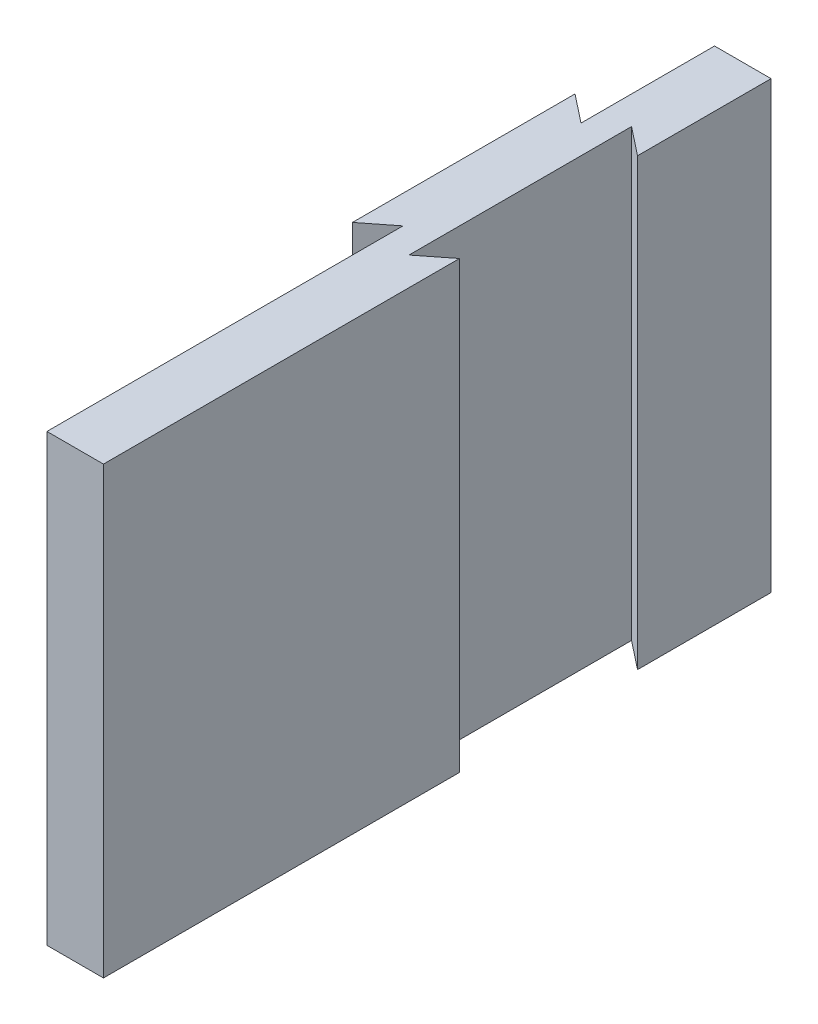
ISO-10303-21;
HEADER;
FILE_DESCRIPTION(('STEP AP214'),'2;1');
FILE_NAME('part.step','',(''),(''),'','','');
FILE_SCHEMA(('AUTOMOTIVE_DESIGN { 1 0 10303 214 1 1 1 1 }'));
ENDSEC;
DATA;
#1=APPLICATION_CONTEXT('core data for automotive mechanical design processes');
#2=APPLICATION_PROTOCOL_DEFINITION('international standard','automotive_design',2000,#1);
#3=PRODUCT_CONTEXT('',#1,'mechanical');
#4=PRODUCT('Part','Part','',(#3));
#5=PRODUCT_RELATED_PRODUCT_CATEGORY('part','',(#4));
#6=PRODUCT_DEFINITION_FORMATION('','',#4);
#7=PRODUCT_DEFINITION_CONTEXT('part definition',#1,'design');
#8=PRODUCT_DEFINITION('design','',#6,#7);
#9=PRODUCT_DEFINITION_SHAPE('','',#8);
#10=(LENGTH_UNIT() NAMED_UNIT(*) SI_UNIT(.MILLI.,.METRE.));
#11=(NAMED_UNIT(*) PLANE_ANGLE_UNIT() SI_UNIT($,.RADIAN.));
#12=(NAMED_UNIT(*) SI_UNIT($,.STERADIAN.) SOLID_ANGLE_UNIT());
#13=UNCERTAINTY_MEASURE_WITH_UNIT(LENGTH_MEASURE(1.E-05),#10,'distance_accuracy_value','');
#14=(GEOMETRIC_REPRESENTATION_CONTEXT(3) GLOBAL_UNCERTAINTY_ASSIGNED_CONTEXT((#13)) GLOBAL_UNIT_ASSIGNED_CONTEXT((#10,
#11,#12)) REPRESENTATION_CONTEXT('',''));
#15=CARTESIAN_POINT('',(0.,0.,0.));
#16=DIRECTION('',(0.,0.,1.));
#17=DIRECTION('',(1.,0.,0.));
#18=AXIS2_PLACEMENT_3D('',#15,#16,#17);
#19=CARTESIAN_POINT('',(1.27,20.,0.));
#20=DIRECTION('',(-1.,0.,0.));
#21=DIRECTION('',(0.,0.,1.));
#22=AXIS2_PLACEMENT_3D('',#19,#20,#21);
#23=PLANE('',#22);
#24=DIRECTION('',(0.,0.,-1.));
#25=VECTOR('',#24,1.);
#26=CARTESIAN_POINT('',(1.27,0.,0.));
#27=LINE('',#26,#25);
#28=CARTESIAN_POINT('',(1.27,0.,-4.));
#29=VERTEX_POINT('',#28);
#30=CARTESIAN_POINT('',(1.27,0.,-9.99999999999999));
#31=VERTEX_POINT('',#30);
#32=EDGE_CURVE('E190',#29,#31,#27,.T.);
#33=ORIENTED_EDGE('',*,*,#32,.T.);
#34=DIRECTION('',(0.,-1.,0.));
#35=VECTOR('',#34,1.);
#36=CARTESIAN_POINT('',(1.27,20.,-9.99999999999999));
#37=LINE('',#36,#35);
#38=CARTESIAN_POINT('',(1.27,20.,-9.99999999999999));
#39=VERTEX_POINT('',#38);
#40=EDGE_CURVE('E208',#39,#31,#37,.T.);
#41=ORIENTED_EDGE('',*,*,#40,.F.);
#42=DIRECTION('',(0.,0.,-1.));
#43=VECTOR('',#42,1.);
#44=CARTESIAN_POINT('',(1.27,20.,0.));
#45=LINE('',#44,#43);
#46=CARTESIAN_POINT('',(1.27,20.,-4.));
#47=VERTEX_POINT('',#46);
#48=EDGE_CURVE('E265',#47,#39,#45,.T.);
#49=ORIENTED_EDGE('',*,*,#48,.F.);
#50=DIRECTION('',(0.,-1.,0.));
#51=VECTOR('',#50,1.);
#52=CARTESIAN_POINT('',(1.27,20.,-4.));
#53=LINE('',#52,#51);
#54=EDGE_CURVE('E212',#47,#29,#53,.T.);
#55=ORIENTED_EDGE('',*,*,#54,.T.);
#56=EDGE_LOOP('',(#33,#41,#49,#55));
#57=FACE_BOUND('',#56,.T.);
#58=ADVANCED_FACE('F77',(#57),#23,.F.);
#59=CARTESIAN_POINT('',(2.43024991388878,20.,-3.08641739063876));
#60=DIRECTION('',(-0.618640866636087,0.,0.785673900627831));
#61=DIRECTION('',(0.785673900627831,0.,0.618640866636087));
#62=AXIS2_PLACEMENT_3D('',#59,#60,#61);
#63=PLANE('',#62);
#64=DIRECTION('',(-0.785673900627831,0.,-0.618640866636087));
#65=VECTOR('',#64,1.);
#66=CARTESIAN_POINT('',(2.43024991388878,0.,-3.08641739063876));
#67=LINE('',#66,#65);
#68=CARTESIAN_POINT('',(0.,0.,-5.));
#69=VERTEX_POINT('',#68);
#70=EDGE_CURVE('E227',#29,#69,#67,.T.);
#71=ORIENTED_EDGE('',*,*,#70,.F.);
#72=ORIENTED_EDGE('',*,*,#54,.F.);
#73=DIRECTION('',(-0.785673900627831,0.,-0.618640866636087));
#74=VECTOR('',#73,1.);
#75=CARTESIAN_POINT('',(2.43024991388878,20.,-3.08641739063876));
#76=LINE('',#75,#74);
#77=CARTESIAN_POINT('',(0.,20.,-5.));
#78=VERTEX_POINT('',#77);
#79=EDGE_CURVE('E230',#47,#78,#76,.T.);
#80=ORIENTED_EDGE('',*,*,#79,.T.);
#81=DIRECTION('',(0.,-1.,0.));
#82=VECTOR('',#81,1.);
#83=CARTESIAN_POINT('',(0.,20.,-5.));
#84=LINE('',#83,#82);
#85=EDGE_CURVE('E166',#78,#69,#84,.T.);
#86=ORIENTED_EDGE('',*,*,#85,.T.);
#87=EDGE_LOOP('',(#71,#72,#80,#86));
#88=FACE_BOUND('',#87,.T.);
#89=ADVANCED_FACE('F223',(#88),#63,.T.);
#90=CARTESIAN_POINT('',(0.,20.,0.));
#91=DIRECTION('',(1.,0.,0.));
#92=DIRECTION('',(0.,0.,-1.));
#93=AXIS2_PLACEMENT_3D('',#90,#91,#92);
#94=PLANE('',#93);
#95=DIRECTION('',(0.,0.,1.));
#96=VECTOR('',#95,1.);
#97=CARTESIAN_POINT('',(0.,0.,0.));
#98=LINE('',#97,#96);
#99=CARTESIAN_POINT('',(0.,0.,5.));
#100=VERTEX_POINT('',#99);
#101=EDGE_CURVE('E237',#69,#100,#98,.T.);
#102=ORIENTED_EDGE('',*,*,#101,.F.);
#103=ORIENTED_EDGE('',*,*,#85,.F.);
#104=DIRECTION('',(0.,0.,1.));
#105=VECTOR('',#104,1.);
#106=CARTESIAN_POINT('',(0.,20.,0.));
#107=LINE('',#106,#105);
#108=CARTESIAN_POINT('',(0.,20.,5.));
#109=VERTEX_POINT('',#108);
#110=EDGE_CURVE('E268',#78,#109,#107,.T.);
#111=ORIENTED_EDGE('',*,*,#110,.T.);
#112=DIRECTION('',(0.,-1.,0.));
#113=VECTOR('',#112,1.);
#114=CARTESIAN_POINT('',(0.,20.,5.));
#115=LINE('',#114,#113);
#116=EDGE_CURVE('E157',#109,#100,#115,.T.);
#117=ORIENTED_EDGE('',*,*,#116,.T.);
#118=EDGE_LOOP('',(#102,#103,#111,#117));
#119=FACE_BOUND('',#118,.T.);
#120=ADVANCED_FACE('F238',(#119),#94,.T.);
#121=CARTESIAN_POINT('',(2.43024991388878,20.,3.08641739063876));
#122=DIRECTION('',(0.618640866636087,0.,0.785673900627831));
#123=DIRECTION('',(0.785673900627831,0.,-0.618640866636087));
#124=AXIS2_PLACEMENT_3D('',#121,#122,#123);
#125=PLANE('',#124);
#126=DIRECTION('',(-0.785673900627831,0.,0.618640866636087));
#127=VECTOR('',#126,1.);
#128=CARTESIAN_POINT('',(2.43024991388878,0.,3.08641739063876));
#129=LINE('',#128,#127);
#130=CARTESIAN_POINT('',(1.27,0.,4.));
#131=VERTEX_POINT('',#130);
#132=EDGE_CURVE('E242',#131,#100,#129,.T.);
#133=ORIENTED_EDGE('',*,*,#132,.T.);
#134=ORIENTED_EDGE('',*,*,#116,.F.);
#135=DIRECTION('',(-0.785673900627831,0.,0.618640866636087));
#136=VECTOR('',#135,1.);
#137=CARTESIAN_POINT('',(2.43024991388878,20.,3.08641739063876));
#138=LINE('',#137,#136);
#139=CARTESIAN_POINT('',(1.27,20.,4.));
#140=VERTEX_POINT('',#139);
#141=EDGE_CURVE('E271',#140,#109,#138,.T.);
#142=ORIENTED_EDGE('',*,*,#141,.F.);
#143=DIRECTION('',(0.,-1.,0.));
#144=VECTOR('',#143,1.);
#145=CARTESIAN_POINT('',(1.27,20.,4.));
#146=LINE('',#145,#144);
#147=EDGE_CURVE('E152',#140,#131,#146,.T.);
#148=ORIENTED_EDGE('',*,*,#147,.T.);
#149=EDGE_LOOP('',(#133,#134,#142,#148));
#150=FACE_BOUND('',#149,.T.);
#151=ADVANCED_FACE('F319',(#150),#125,.F.);
#152=CARTESIAN_POINT('',(1.27,0.,20.));
#153=VERTEX_POINT('',#152);
#154=EDGE_CURVE('E249',#153,#131,#27,.T.);
#155=ORIENTED_EDGE('',*,*,#154,.T.);
#156=ORIENTED_EDGE('',*,*,#147,.F.);
#157=CARTESIAN_POINT('',(1.27,20.,20.));
#158=VERTEX_POINT('',#157);
#159=EDGE_CURVE('E196',#158,#140,#45,.T.);
#160=ORIENTED_EDGE('',*,*,#159,.F.);
#161=DIRECTION('',(0.,-1.,0.));
#162=VECTOR('',#161,1.);
#163=CARTESIAN_POINT('',(1.27,20.,20.));
#164=LINE('',#163,#162);
#165=EDGE_CURVE('E197',#158,#153,#164,.T.);
#166=ORIENTED_EDGE('',*,*,#165,.T.);
#167=EDGE_LOOP('',(#155,#156,#160,#166));
#168=FACE_BOUND('',#167,.T.);
#169=ADVANCED_FACE('F336',(#168),#23,.F.);
#170=CARTESIAN_POINT('',(0.,20.,-9.99999999999999));
#171=DIRECTION('',(0.,0.,1.));
#172=DIRECTION('',(1.,0.,0.));
#173=AXIS2_PLACEMENT_3D('',#170,#171,#172);
#174=PLANE('',#173);
#175=DIRECTION('',(-1.,0.,0.));
#176=VECTOR('',#175,1.);
#177=CARTESIAN_POINT('',(0.,0.,-9.99999999999999));
#178=LINE('',#177,#176);
#179=CARTESIAN_POINT('',(-1.27,0.,-10.));
#180=VERTEX_POINT('',#179);
#181=EDGE_CURVE('E185',#31,#180,#178,.T.);
#182=ORIENTED_EDGE('',*,*,#181,.T.);
#183=DIRECTION('',(0.,-1.,0.));
#184=VECTOR('',#183,1.);
#185=CARTESIAN_POINT('',(-1.27,20.,-10.));
#186=LINE('',#185,#184);
#187=CARTESIAN_POINT('',(-1.27,20.,-10.));
#188=VERTEX_POINT('',#187);
#189=EDGE_CURVE('E182',#188,#180,#186,.T.);
#190=ORIENTED_EDGE('',*,*,#189,.F.);
#191=DIRECTION('',(-1.,0.,0.));
#192=VECTOR('',#191,1.);
#193=CARTESIAN_POINT('',(0.,20.,-9.99999999999999));
#194=LINE('',#193,#192);
#195=EDGE_CURVE('E261',#39,#188,#194,.T.);
#196=ORIENTED_EDGE('',*,*,#195,.F.);
#197=ORIENTED_EDGE('',*,*,#40,.T.);
#198=EDGE_LOOP('',(#182,#190,#196,#197));
#199=FACE_BOUND('',#198,.T.);
#200=ADVANCED_FACE('F295',(#199),#174,.F.);
#201=CARTESIAN_POINT('',(0.,20.,20.));
#202=DIRECTION('',(0.,0.,1.));
#203=DIRECTION('',(1.,0.,0.));
#204=AXIS2_PLACEMENT_3D('',#201,#202,#203);
#205=PLANE('',#204);
#206=DIRECTION('',(-1.,0.,0.));
#207=VECTOR('',#206,1.);
#208=CARTESIAN_POINT('',(0.,0.,20.));
#209=LINE('',#208,#207);
#210=CARTESIAN_POINT('',(-1.27,0.,20.));
#211=VERTEX_POINT('',#210);
#212=EDGE_CURVE('E189',#153,#211,#209,.T.);
#213=ORIENTED_EDGE('',*,*,#212,.F.);
#214=ORIENTED_EDGE('',*,*,#165,.F.);
#215=DIRECTION('',(-1.,0.,0.));
#216=VECTOR('',#215,1.);
#217=CARTESIAN_POINT('',(0.,20.,20.));
#218=LINE('',#217,#216);
#219=CARTESIAN_POINT('',(-1.27,20.,20.));
#220=VERTEX_POINT('',#219);
#221=EDGE_CURVE('E202',#158,#220,#218,.T.);
#222=ORIENTED_EDGE('',*,*,#221,.T.);
#223=DIRECTION('',(0.,-1.,0.));
#224=VECTOR('',#223,1.);
#225=CARTESIAN_POINT('',(-1.27,20.,20.));
#226=LINE('',#225,#224);
#227=EDGE_CURVE('E201',#220,#211,#226,.T.);
#228=ORIENTED_EDGE('',*,*,#227,.T.);
#229=EDGE_LOOP('',(#213,#214,#222,#228));
#230=FACE_BOUND('',#229,.T.);
#231=ADVANCED_FACE('F322',(#230),#205,.T.);
#232=CARTESIAN_POINT('',(0.,0.,0.));
#233=DIRECTION('',(0.,1.,0.));
#234=DIRECTION('',(0.,0.,1.));
#235=AXIS2_PLACEMENT_3D('',#232,#233,#234);
#236=PLANE('',#235);
#237=ORIENTED_EDGE('',*,*,#154,.F.);
#238=ORIENTED_EDGE('',*,*,#212,.T.);
#239=DIRECTION('',(0.,0.,-1.));
#240=VECTOR('',#239,1.);
#241=CARTESIAN_POINT('',(-1.27,0.,0.));
#242=LINE('',#241,#240);
#243=CARTESIAN_POINT('',(-1.27,0.,4.));
#244=VERTEX_POINT('',#243);
#245=EDGE_CURVE('E140',#211,#244,#242,.T.);
#246=ORIENTED_EDGE('',*,*,#245,.T.);
#247=DIRECTION('',(-0.785673900627831,0.,0.618640866636088));
#248=VECTOR('',#247,1.);
#249=CARTESIAN_POINT('',(-1.27,0.,4.));
#250=LINE('',#249,#248);
#251=CARTESIAN_POINT('',(-2.54,0.,5.));
#252=VERTEX_POINT('',#251);
#253=EDGE_CURVE('E124',#244,#252,#250,.T.);
#254=ORIENTED_EDGE('',*,*,#253,.T.);
#255=DIRECTION('',(0.,0.,1.));
#256=VECTOR('',#255,1.);
#257=CARTESIAN_POINT('',(-2.54,0.,-5.));
#258=LINE('',#257,#256);
#259=CARTESIAN_POINT('',(-2.54,0.,-5.));
#260=VERTEX_POINT('',#259);
#261=EDGE_CURVE('E114',#260,#252,#258,.T.);
#262=ORIENTED_EDGE('',*,*,#261,.F.);
#263=DIRECTION('',(-0.785673900627831,0.,-0.618640866636088));
#264=VECTOR('',#263,1.);
#265=CARTESIAN_POINT('',(-1.27,0.,-4.));
#266=LINE('',#265,#264);
#267=CARTESIAN_POINT('',(-1.27,0.,-4.));
#268=VERTEX_POINT('',#267);
#269=EDGE_CURVE('E134',#268,#260,#266,.T.);
#270=ORIENTED_EDGE('',*,*,#269,.F.);
#271=EDGE_CURVE('E178',#268,#180,#242,.T.);
#272=ORIENTED_EDGE('',*,*,#271,.T.);
#273=ORIENTED_EDGE('',*,*,#181,.F.);
#274=ORIENTED_EDGE('',*,*,#32,.F.);
#275=ORIENTED_EDGE('',*,*,#70,.T.);
#276=ORIENTED_EDGE('',*,*,#101,.T.);
#277=ORIENTED_EDGE('',*,*,#132,.F.);
#278=EDGE_LOOP('',(#237,#238,#246,#254,#262,#270,#272,#273,#274,#275,#276,#277));
#279=FACE_BOUND('',#278,.T.);
#280=ADVANCED_FACE('F137',(#279),#236,.F.);
#281=CARTESIAN_POINT('',(0.,20.,0.));
#282=DIRECTION('',(0.,1.,0.));
#283=DIRECTION('',(0.,0.,1.));
#284=AXIS2_PLACEMENT_3D('',#281,#282,#283);
#285=PLANE('',#284);
#286=ORIENTED_EDGE('',*,*,#159,.T.);
#287=ORIENTED_EDGE('',*,*,#141,.T.);
#288=ORIENTED_EDGE('',*,*,#110,.F.);
#289=ORIENTED_EDGE('',*,*,#79,.F.);
#290=ORIENTED_EDGE('',*,*,#48,.T.);
#291=ORIENTED_EDGE('',*,*,#195,.T.);
#292=DIRECTION('',(0.,0.,-1.));
#293=VECTOR('',#292,1.);
#294=CARTESIAN_POINT('',(-1.27,20.,0.));
#295=LINE('',#294,#293);
#296=CARTESIAN_POINT('',(-1.27,20.,-4.));
#297=VERTEX_POINT('',#296);
#298=EDGE_CURVE('E260',#297,#188,#295,.T.);
#299=ORIENTED_EDGE('',*,*,#298,.F.);
#300=DIRECTION('',(-0.785673900627831,0.,-0.618640866636088));
#301=VECTOR('',#300,1.);
#302=CARTESIAN_POINT('',(-1.27,20.,-4.));
#303=LINE('',#302,#301);
#304=CARTESIAN_POINT('',(-2.54,20.,-5.));
#305=VERTEX_POINT('',#304);
#306=EDGE_CURVE('E142',#297,#305,#303,.T.);
#307=ORIENTED_EDGE('',*,*,#306,.T.);
#308=DIRECTION('',(0.,0.,1.));
#309=VECTOR('',#308,1.);
#310=CARTESIAN_POINT('',(-2.54,20.,-5.));
#311=LINE('',#310,#309);
#312=CARTESIAN_POINT('',(-2.54,20.,5.));
#313=VERTEX_POINT('',#312);
#314=EDGE_CURVE('E146',#305,#313,#311,.T.);
#315=ORIENTED_EDGE('',*,*,#314,.T.);
#316=DIRECTION('',(-0.785673900627831,0.,0.618640866636088));
#317=VECTOR('',#316,1.);
#318=CARTESIAN_POINT('',(-1.27,20.,4.));
#319=LINE('',#318,#317);
#320=CARTESIAN_POINT('',(-1.27,20.,4.));
#321=VERTEX_POINT('',#320);
#322=EDGE_CURVE('E127',#321,#313,#319,.T.);
#323=ORIENTED_EDGE('',*,*,#322,.F.);
#324=EDGE_CURVE('E257',#220,#321,#295,.T.);
#325=ORIENTED_EDGE('',*,*,#324,.F.);
#326=ORIENTED_EDGE('',*,*,#221,.F.);
#327=EDGE_LOOP('',(#286,#287,#288,#289,#290,#291,#299,#307,#315,#323,#325,#326));
#328=FACE_BOUND('',#327,.T.);
#329=ADVANCED_FACE('F286',(#328),#285,.T.);
#330=CARTESIAN_POINT('',(-1.27,20.,0.));
#331=DIRECTION('',(-1.,0.,0.));
#332=DIRECTION('',(0.,0.,1.));
#333=AXIS2_PLACEMENT_3D('',#330,#331,#332);
#334=PLANE('',#333);
#335=ORIENTED_EDGE('',*,*,#324,.T.);
#336=DIRECTION('',(0.,-1.,0.));
#337=VECTOR('',#336,1.);
#338=CARTESIAN_POINT('',(-1.27,20.,4.));
#339=LINE('',#338,#337);
#340=EDGE_CURVE('E88',#321,#244,#339,.T.);
#341=ORIENTED_EDGE('',*,*,#340,.T.);
#342=ORIENTED_EDGE('',*,*,#245,.F.);
#343=ORIENTED_EDGE('',*,*,#227,.F.);
#344=EDGE_LOOP('',(#335,#341,#342,#343));
#345=FACE_BOUND('',#344,.T.);
#346=ADVANCED_FACE('F324',(#345),#334,.T.);
#347=DIRECTION('',(0.,-1.,0.));
#348=VECTOR('',#347,1.);
#349=CARTESIAN_POINT('',(-1.27,20.,-4.));
#350=LINE('',#349,#348);
#351=EDGE_CURVE('E12',#297,#268,#350,.T.);
#352=ORIENTED_EDGE('',*,*,#351,.F.);
#353=ORIENTED_EDGE('',*,*,#298,.T.);
#354=ORIENTED_EDGE('',*,*,#189,.T.);
#355=ORIENTED_EDGE('',*,*,#271,.F.);
#356=EDGE_LOOP('',(#352,#353,#354,#355));
#357=FACE_BOUND('',#356,.T.);
#358=ADVANCED_FACE('F180',(#357),#334,.T.);
#359=CARTESIAN_POINT('',(-2.54,20.,-5.));
#360=DIRECTION('',(1.,0.,0.));
#361=DIRECTION('',(0.,0.,-1.));
#362=AXIS2_PLACEMENT_3D('',#359,#360,#361);
#363=PLANE('',#362);
#364=ORIENTED_EDGE('',*,*,#261,.T.);
#365=DIRECTION('',(0.,-1.,0.));
#366=VECTOR('',#365,1.);
#367=CARTESIAN_POINT('',(-2.54,20.,5.));
#368=LINE('',#367,#366);
#369=EDGE_CURVE('E121',#313,#252,#368,.T.);
#370=ORIENTED_EDGE('',*,*,#369,.F.);
#371=ORIENTED_EDGE('',*,*,#314,.F.);
#372=DIRECTION('',(0.,-1.,0.));
#373=VECTOR('',#372,1.);
#374=CARTESIAN_POINT('',(-2.54,20.,-5.));
#375=LINE('',#374,#373);
#376=EDGE_CURVE('E81',#305,#260,#375,.T.);
#377=ORIENTED_EDGE('',*,*,#376,.T.);
#378=EDGE_LOOP('',(#364,#370,#371,#377));
#379=FACE_BOUND('',#378,.T.);
#380=ADVANCED_FACE('F130',(#379),#363,.F.);
#381=CARTESIAN_POINT('',(-1.27,20.,4.));
#382=DIRECTION('',(0.618640866636087,0.,0.785673900627831));
#383=DIRECTION('',(0.785673900627831,0.,-0.618640866636087));
#384=AXIS2_PLACEMENT_3D('',#381,#382,#383);
#385=PLANE('',#384);
#386=ORIENTED_EDGE('',*,*,#253,.F.);
#387=ORIENTED_EDGE('',*,*,#340,.F.);
#388=ORIENTED_EDGE('',*,*,#322,.T.);
#389=ORIENTED_EDGE('',*,*,#369,.T.);
#390=EDGE_LOOP('',(#386,#387,#388,#389));
#391=FACE_BOUND('',#390,.T.);
#392=ADVANCED_FACE('F122',(#391),#385,.T.);
#393=CARTESIAN_POINT('',(-1.27,20.,-4.));
#394=DIRECTION('',(-0.618640866636087,0.,0.785673900627831));
#395=DIRECTION('',(0.785673900627831,0.,0.618640866636087));
#396=AXIS2_PLACEMENT_3D('',#393,#394,#395);
#397=PLANE('',#396);
#398=ORIENTED_EDGE('',*,*,#269,.T.);
#399=ORIENTED_EDGE('',*,*,#376,.F.);
#400=ORIENTED_EDGE('',*,*,#306,.F.);
#401=ORIENTED_EDGE('',*,*,#351,.T.);
#402=EDGE_LOOP('',(#398,#399,#400,#401));
#403=FACE_BOUND('',#402,.T.);
#404=ADVANCED_FACE('F79',(#403),#397,.F.);
#405=CLOSED_SHELL('',(#58,#89,#120,#151,#169,#200,#231,#280,#329,#346,#358,#380,#392,#404));
#406=MANIFOLD_SOLID_BREP('B2',#405);
#407=ADVANCED_BREP_SHAPE_REPRESENTATION('',(#18,#406),#14);
#408=SHAPE_DEFINITION_REPRESENTATION(#9,#407);
ENDSEC;
END-ISO-10303-21;
